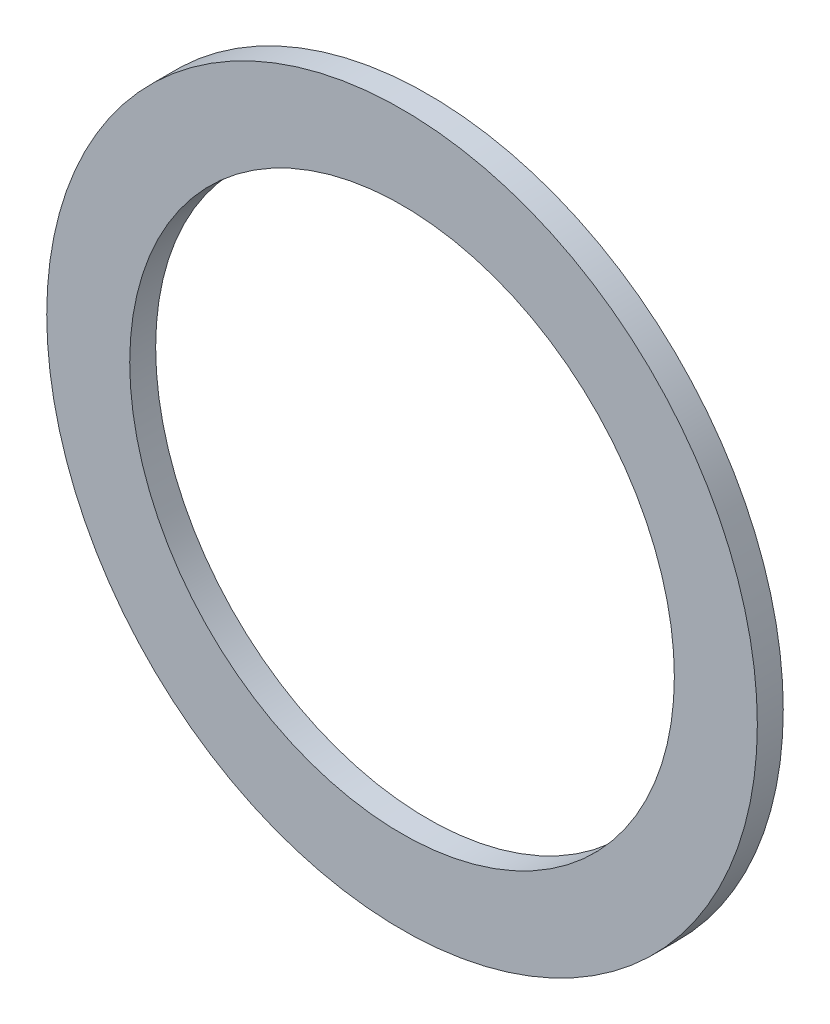
ISO-10303-21;
HEADER;
FILE_DESCRIPTION(('STEP AP214'),'2;1');
FILE_NAME('part.step','',(''),(''),'','','');
FILE_SCHEMA(('AUTOMOTIVE_DESIGN { 1 0 10303 214 1 1 1 1 }'));
ENDSEC;
DATA;
#1=APPLICATION_CONTEXT('core data for automotive mechanical design processes');
#2=APPLICATION_PROTOCOL_DEFINITION('international standard','automotive_design',2000,#1);
#3=PRODUCT_CONTEXT('',#1,'mechanical');
#4=PRODUCT('Part','Part','',(#3));
#5=PRODUCT_RELATED_PRODUCT_CATEGORY('part','',(#4));
#6=PRODUCT_DEFINITION_FORMATION('','',#4);
#7=PRODUCT_DEFINITION_CONTEXT('part definition',#1,'design');
#8=PRODUCT_DEFINITION('design','',#6,#7);
#9=PRODUCT_DEFINITION_SHAPE('','',#8);
#10=(LENGTH_UNIT() NAMED_UNIT(*) SI_UNIT(.MILLI.,.METRE.));
#11=(NAMED_UNIT(*) PLANE_ANGLE_UNIT() SI_UNIT($,.RADIAN.));
#12=(NAMED_UNIT(*) SI_UNIT($,.STERADIAN.) SOLID_ANGLE_UNIT());
#13=UNCERTAINTY_MEASURE_WITH_UNIT(LENGTH_MEASURE(1.E-05),#10,'distance_accuracy_value','');
#14=(GEOMETRIC_REPRESENTATION_CONTEXT(3) GLOBAL_UNCERTAINTY_ASSIGNED_CONTEXT((#13)) GLOBAL_UNIT_ASSIGNED_CONTEXT((#10,
#11,#12)) REPRESENTATION_CONTEXT('',''));
#15=CARTESIAN_POINT('',(0.,0.,0.));
#16=DIRECTION('',(0.,0.,1.));
#17=DIRECTION('',(1.,0.,0.));
#18=AXIS2_PLACEMENT_3D('',#15,#16,#17);
#19=CARTESIAN_POINT('',(0.,0.,-1.27));
#20=DIRECTION('',(0.,0.,1.));
#21=DIRECTION('',(1.,0.,0.));
#22=AXIS2_PLACEMENT_3D('',#19,#20,#21);
#23=PLANE('',#22);
#24=CARTESIAN_POINT('',(0.,0.,-1.27));
#25=DIRECTION('',(0.,0.,1.));
#26=DIRECTION('',(1.,0.,0.));
#27=AXIS2_PLACEMENT_3D('',#24,#25,#26);
#28=CIRCLE('',#27,26.67);
#29=CARTESIAN_POINT('',(26.67,0.,-1.27));
#30=VERTEX_POINT('',#29);
#31=EDGE_CURVE('E11',#30,#30,#28,.T.);
#32=ORIENTED_EDGE('',*,*,#31,.T.);
#33=EDGE_LOOP('',(#32));
#34=FACE_BOUND('',#33,.T.);
#35=CARTESIAN_POINT('',(0.,0.,-1.27));
#36=DIRECTION('',(0.,0.,1.));
#37=DIRECTION('',(1.,0.,0.));
#38=AXIS2_PLACEMENT_3D('',#35,#36,#37);
#39=CIRCLE('',#38,34.798);
#40=CARTESIAN_POINT('',(34.798,0.,-1.27));
#41=VERTEX_POINT('',#40);
#42=EDGE_CURVE('E44',#41,#41,#39,.T.);
#43=ORIENTED_EDGE('',*,*,#42,.F.);
#44=EDGE_LOOP('',(#43));
#45=FACE_BOUND('',#44,.T.);
#46=ADVANCED_FACE('F34',(#34,#45),#23,.F.);
#47=CARTESIAN_POINT('',(0.,0.,1.27));
#48=DIRECTION('',(0.,0.,1.));
#49=DIRECTION('',(1.,0.,0.));
#50=AXIS2_PLACEMENT_3D('',#47,#48,#49);
#51=PLANE('',#50);
#52=CARTESIAN_POINT('',(0.,0.,1.27));
#53=DIRECTION('',(0.,0.,1.));
#54=DIRECTION('',(1.,0.,0.));
#55=AXIS2_PLACEMENT_3D('',#52,#53,#54);
#56=CIRCLE('',#55,26.67);
#57=CARTESIAN_POINT('',(26.67,0.,1.27));
#58=VERTEX_POINT('',#57);
#59=EDGE_CURVE('E40',#58,#58,#56,.T.);
#60=ORIENTED_EDGE('',*,*,#59,.F.);
#61=EDGE_LOOP('',(#60));
#62=FACE_BOUND('',#61,.T.);
#63=CARTESIAN_POINT('',(0.,0.,1.27));
#64=DIRECTION('',(0.,0.,1.));
#65=DIRECTION('',(1.,0.,0.));
#66=AXIS2_PLACEMENT_3D('',#63,#64,#65);
#67=CIRCLE('',#66,34.798);
#68=CARTESIAN_POINT('',(34.798,0.,1.27));
#69=VERTEX_POINT('',#68);
#70=EDGE_CURVE('E48',#69,#69,#67,.T.);
#71=ORIENTED_EDGE('',*,*,#70,.T.);
#72=EDGE_LOOP('',(#71));
#73=FACE_BOUND('',#72,.T.);
#74=ADVANCED_FACE('F54',(#62,#73),#51,.T.);
#75=CARTESIAN_POINT('',(0.,0.,-1.27));
#76=DIRECTION('',(0.,0.,1.));
#77=DIRECTION('',(1.,0.,0.));
#78=AXIS2_PLACEMENT_3D('',#75,#76,#77);
#79=CYLINDRICAL_SURFACE('',#78,26.67);
#80=ORIENTED_EDGE('',*,*,#31,.F.);
#81=EDGE_LOOP('',(#80));
#82=FACE_BOUND('',#81,.T.);
#83=ORIENTED_EDGE('',*,*,#59,.T.);
#84=EDGE_LOOP('',(#83));
#85=FACE_BOUND('',#84,.T.);
#86=ADVANCED_FACE('F58',(#82,#85),#79,.F.);
#87=CARTESIAN_POINT('',(0.,0.,-1.27));
#88=DIRECTION('',(0.,0.,1.));
#89=DIRECTION('',(1.,0.,0.));
#90=AXIS2_PLACEMENT_3D('',#87,#88,#89);
#91=CYLINDRICAL_SURFACE('',#90,34.798);
#92=ORIENTED_EDGE('',*,*,#42,.T.);
#93=EDGE_LOOP('',(#92));
#94=FACE_BOUND('',#93,.T.);
#95=ORIENTED_EDGE('',*,*,#70,.F.);
#96=EDGE_LOOP('',(#95));
#97=FACE_BOUND('',#96,.T.);
#98=ADVANCED_FACE('F56',(#94,#97),#91,.T.);
#99=CLOSED_SHELL('',(#46,#74,#86,#98));
#100=MANIFOLD_SOLID_BREP('B2',#99);
#101=ADVANCED_BREP_SHAPE_REPRESENTATION('',(#18,#100),#14);
#102=SHAPE_DEFINITION_REPRESENTATION(#9,#101);
ENDSEC;
END-ISO-10303-21;
